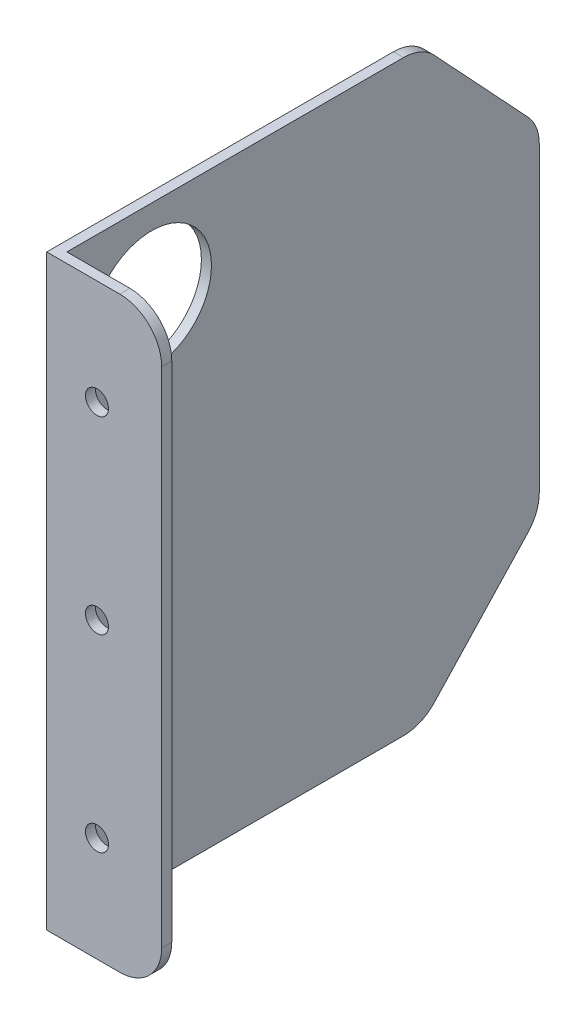
ISO-10303-21;
HEADER;
FILE_DESCRIPTION(('STEP AP214'),'2;1');
FILE_NAME('part.step','',(''),(''),'','','');
FILE_SCHEMA(('AUTOMOTIVE_DESIGN { 1 0 10303 214 1 1 1 1 }'));
ENDSEC;
DATA;
#1=APPLICATION_CONTEXT('core data for automotive mechanical design processes');
#2=APPLICATION_PROTOCOL_DEFINITION('international standard','automotive_design',2000,#1);
#3=PRODUCT_CONTEXT('',#1,'mechanical');
#4=PRODUCT('Part','Part','',(#3));
#5=PRODUCT_RELATED_PRODUCT_CATEGORY('part','',(#4));
#6=PRODUCT_DEFINITION_FORMATION('','',#4);
#7=PRODUCT_DEFINITION_CONTEXT('part definition',#1,'design');
#8=PRODUCT_DEFINITION('design','',#6,#7);
#9=PRODUCT_DEFINITION_SHAPE('','',#8);
#10=(LENGTH_UNIT() NAMED_UNIT(*) SI_UNIT(.MILLI.,.METRE.));
#11=(NAMED_UNIT(*) PLANE_ANGLE_UNIT() SI_UNIT($,.RADIAN.));
#12=(NAMED_UNIT(*) SI_UNIT($,.STERADIAN.) SOLID_ANGLE_UNIT());
#13=UNCERTAINTY_MEASURE_WITH_UNIT(LENGTH_MEASURE(1.E-05),#10,'distance_accuracy_value','');
#14=(GEOMETRIC_REPRESENTATION_CONTEXT(3) GLOBAL_UNCERTAINTY_ASSIGNED_CONTEXT((#13)) GLOBAL_UNIT_ASSIGNED_CONTEXT((#10,
#11,#12)) REPRESENTATION_CONTEXT('',''));
#15=CARTESIAN_POINT('',(0.,0.,0.));
#16=DIRECTION('',(0.,0.,1.));
#17=DIRECTION('',(1.,0.,0.));
#18=AXIS2_PLACEMENT_3D('',#15,#16,#17);
#19=CARTESIAN_POINT('',(2.4,0.,0.));
#20=DIRECTION('',(0.,0.,-1.));
#21=DIRECTION('',(0.,1.,0.));
#22=AXIS2_PLACEMENT_3D('',#19,#20,#21);
#23=PLANE('',#22);
#24=CARTESIAN_POINT('',(11.9749835807568,-115.,0.));
#25=DIRECTION('',(0.,0.,1.));
#26=DIRECTION('',(1.,0.,0.));
#27=AXIS2_PLACEMENT_3D('',#24,#25,#26);
#28=CIRCLE('',#27,2.75);
#29=CARTESIAN_POINT('',(14.7249835807568,-115.,0.));
#30=VERTEX_POINT('',#29);
#31=EDGE_CURVE('E492',#30,#30,#28,.T.);
#32=ORIENTED_EDGE('',*,*,#31,.F.);
#33=EDGE_LOOP('',(#32));
#34=FACE_BOUND('',#33,.T.);
#35=CARTESIAN_POINT('',(11.9749835807568,-25.,0.));
#36=DIRECTION('',(0.,0.,1.));
#37=DIRECTION('',(1.,0.,0.));
#38=AXIS2_PLACEMENT_3D('',#35,#36,#37);
#39=CIRCLE('',#38,2.75);
#40=CARTESIAN_POINT('',(14.7249835807568,-25.,0.));
#41=VERTEX_POINT('',#40);
#42=EDGE_CURVE('E497',#41,#41,#39,.T.);
#43=ORIENTED_EDGE('',*,*,#42,.F.);
#44=EDGE_LOOP('',(#43));
#45=FACE_BOUND('',#44,.T.);
#46=CARTESIAN_POINT('',(11.9749835807568,-70.,0.));
#47=DIRECTION('',(0.,0.,1.));
#48=DIRECTION('',(1.,0.,0.));
#49=AXIS2_PLACEMENT_3D('',#46,#47,#48);
#50=CIRCLE('',#49,2.75);
#51=CARTESIAN_POINT('',(14.7249835807568,-70.,0.));
#52=VERTEX_POINT('',#51);
#53=EDGE_CURVE('E258',#52,#52,#50,.T.);
#54=ORIENTED_EDGE('',*,*,#53,.F.);
#55=EDGE_LOOP('',(#54));
#56=FACE_BOUND('',#55,.T.);
#57=DIRECTION('',(-1.,0.,0.));
#58=VECTOR('',#57,1.);
#59=CARTESIAN_POINT('',(2.4,-140.,0.));
#60=LINE('',#59,#58);
#61=CARTESIAN_POINT('',(17.4,-140.,0.));
#62=VERTEX_POINT('',#61);
#63=CARTESIAN_POINT('',(0.,-140.,0.));
#64=VERTEX_POINT('',#63);
#65=EDGE_CURVE('E204',#62,#64,#60,.T.);
#66=ORIENTED_EDGE('',*,*,#65,.F.);
#67=CARTESIAN_POINT('',(17.4,-130.,0.));
#68=DIRECTION('',(0.,0.,-1.));
#69=DIRECTION('',(0.,1.,0.));
#70=AXIS2_PLACEMENT_3D('',#67,#68,#69);
#71=CIRCLE('',#70,10.);
#72=CARTESIAN_POINT('',(27.4,-130.,0.));
#73=VERTEX_POINT('',#72);
#74=EDGE_CURVE('E48',#62,#73,#71,.F.);
#75=ORIENTED_EDGE('',*,*,#74,.T.);
#76=DIRECTION('',(0.,-1.,0.));
#77=VECTOR('',#76,1.);
#78=CARTESIAN_POINT('',(27.4,-140.,0.));
#79=LINE('',#78,#77);
#80=CARTESIAN_POINT('',(27.4,-10.,0.));
#81=VERTEX_POINT('',#80);
#82=EDGE_CURVE('E167',#81,#73,#79,.T.);
#83=ORIENTED_EDGE('',*,*,#82,.F.);
#84=CARTESIAN_POINT('',(17.4,-10.,0.));
#85=DIRECTION('',(0.,0.,-1.));
#86=DIRECTION('',(0.,1.,0.));
#87=AXIS2_PLACEMENT_3D('',#84,#85,#86);
#88=CIRCLE('',#87,10.);
#89=CARTESIAN_POINT('',(17.4,0.,0.));
#90=VERTEX_POINT('',#89);
#91=EDGE_CURVE('E57',#81,#90,#88,.F.);
#92=ORIENTED_EDGE('',*,*,#91,.T.);
#93=DIRECTION('',(-1.,0.,0.));
#94=VECTOR('',#93,1.);
#95=CARTESIAN_POINT('',(2.4,0.,0.));
#96=LINE('',#95,#94);
#97=CARTESIAN_POINT('',(0.,0.,0.));
#98=VERTEX_POINT('',#97);
#99=EDGE_CURVE('E161',#90,#98,#96,.T.);
#100=ORIENTED_EDGE('',*,*,#99,.T.);
#101=DIRECTION('',(0.,-1.,0.));
#102=VECTOR('',#101,1.);
#103=CARTESIAN_POINT('',(0.,0.,0.));
#104=LINE('',#103,#102);
#105=EDGE_CURVE('E176',#98,#64,#104,.T.);
#106=ORIENTED_EDGE('',*,*,#105,.T.);
#107=EDGE_LOOP('',(#66,#75,#83,#92,#100,#106));
#108=FACE_BOUND('',#107,.T.);
#109=ADVANCED_FACE('F39',(#34,#45,#56,#108),#23,.F.);
#110=CARTESIAN_POINT('',(2.4,-140.,0.));
#111=DIRECTION('',(0.,1.,0.));
#112=DIRECTION('',(0.,0.,1.));
#113=AXIS2_PLACEMENT_3D('',#110,#111,#112);
#114=PLANE('',#113);
#115=DIRECTION('',(-1.,0.,0.));
#116=VECTOR('',#115,1.);
#117=CARTESIAN_POINT('',(27.4,-140.,-2.4));
#118=LINE('',#117,#116);
#119=CARTESIAN_POINT('',(17.4,-140.,-2.4));
#120=VERTEX_POINT('',#119);
#121=CARTESIAN_POINT('',(2.4,-140.,-2.4));
#122=VERTEX_POINT('',#121);
#123=EDGE_CURVE('E151',#120,#122,#118,.T.);
#124=ORIENTED_EDGE('',*,*,#123,.F.);
#125=DIRECTION('',(0.,0.,-1.));
#126=VECTOR('',#125,1.);
#127=CARTESIAN_POINT('',(17.4,-140.,0.));
#128=LINE('',#127,#126);
#129=EDGE_CURVE('E61',#120,#62,#128,.F.);
#130=ORIENTED_EDGE('',*,*,#129,.T.);
#131=ORIENTED_EDGE('',*,*,#65,.T.);
#132=DIRECTION('',(0.,0.,-1.));
#133=VECTOR('',#132,1.);
#134=CARTESIAN_POINT('',(0.,-140.,0.));
#135=LINE('',#134,#133);
#136=CARTESIAN_POINT('',(0.,-140.,-82.6544769808779));
#137=VERTEX_POINT('',#136);
#138=EDGE_CURVE('E193',#64,#137,#135,.T.);
#139=ORIENTED_EDGE('',*,*,#138,.T.);
#140=DIRECTION('',(1.,0.,0.));
#141=VECTOR('',#140,1.);
#142=CARTESIAN_POINT('',(2.4,-140.,-82.6544769808779));
#143=LINE('',#142,#141);
#144=CARTESIAN_POINT('',(2.4,-140.,-82.6544769808779));
#145=VERTEX_POINT('',#144);
#146=EDGE_CURVE('E206',#137,#145,#143,.T.);
#147=ORIENTED_EDGE('',*,*,#146,.T.);
#148=DIRECTION('',(0.,0.,-1.));
#149=VECTOR('',#148,1.);
#150=CARTESIAN_POINT('',(2.4,-140.,0.));
#151=LINE('',#150,#149);
#152=EDGE_CURVE('E190',#122,#145,#151,.T.);
#153=ORIENTED_EDGE('',*,*,#152,.F.);
#154=EDGE_LOOP('',(#124,#130,#131,#139,#147,#153));
#155=FACE_BOUND('',#154,.T.);
#156=ADVANCED_FACE('F278',(#155),#114,.F.);
#157=CARTESIAN_POINT('',(2.4,0.,-115.));
#158=DIRECTION('',(0.,0.,1.));
#159=DIRECTION('',(0.,-1.,0.));
#160=AXIS2_PLACEMENT_3D('',#157,#158,#159);
#161=PLANE('',#160);
#162=DIRECTION('',(0.,1.,0.));
#163=VECTOR('',#162,1.);
#164=CARTESIAN_POINT('',(2.4,0.,-115.));
#165=LINE('',#164,#163);
#166=CARTESIAN_POINT('',(2.4,-106.058368193798,-115.));
#167=VERTEX_POINT('',#166);
#168=CARTESIAN_POINT('',(2.4,-33.9416318062023,-115.));
#169=VERTEX_POINT('',#168);
#170=EDGE_CURVE('E165',#167,#169,#165,.T.);
#171=ORIENTED_EDGE('',*,*,#170,.F.);
#172=DIRECTION('',(1.,0.,0.));
#173=VECTOR('',#172,1.);
#174=CARTESIAN_POINT('',(2.4,-106.058368193798,-115.));
#175=LINE('',#174,#173);
#176=CARTESIAN_POINT('',(0.,-106.058368193798,-115.));
#177=VERTEX_POINT('',#176);
#178=EDGE_CURVE('E234',#167,#177,#175,.F.);
#179=ORIENTED_EDGE('',*,*,#178,.T.);
#180=DIRECTION('',(0.,1.,0.));
#181=VECTOR('',#180,1.);
#182=CARTESIAN_POINT('',(0.,0.,-115.));
#183=LINE('',#182,#181);
#184=CARTESIAN_POINT('',(0.,-33.9416318062023,-115.));
#185=VERTEX_POINT('',#184);
#186=EDGE_CURVE('E196',#177,#185,#183,.T.);
#187=ORIENTED_EDGE('',*,*,#186,.T.);
#188=DIRECTION('',(1.,0.,0.));
#189=VECTOR('',#188,1.);
#190=CARTESIAN_POINT('',(2.4,-33.9416318062023,-115.));
#191=LINE('',#190,#189);
#192=EDGE_CURVE('E226',#185,#169,#191,.T.);
#193=ORIENTED_EDGE('',*,*,#192,.T.);
#194=EDGE_LOOP('',(#171,#179,#187,#193));
#195=FACE_BOUND('',#194,.T.);
#196=ADVANCED_FACE('F290',(#195),#161,.F.);
#197=CARTESIAN_POINT('',(2.4,0.,0.));
#198=DIRECTION('',(0.,-1.,0.));
#199=DIRECTION('',(0.,0.,-1.));
#200=AXIS2_PLACEMENT_3D('',#197,#198,#199);
#201=PLANE('',#200);
#202=ORIENTED_EDGE('',*,*,#99,.F.);
#203=DIRECTION('',(0.,0.,1.));
#204=VECTOR('',#203,1.);
#205=CARTESIAN_POINT('',(17.4,0.,0.));
#206=LINE('',#205,#204);
#207=CARTESIAN_POINT('',(17.4,0.,-2.4));
#208=VERTEX_POINT('',#207);
#209=EDGE_CURVE('E11',#90,#208,#206,.F.);
#210=ORIENTED_EDGE('',*,*,#209,.T.);
#211=DIRECTION('',(-1.,0.,0.));
#212=VECTOR('',#211,1.);
#213=CARTESIAN_POINT('',(27.4,0.,-2.4));
#214=LINE('',#213,#212);
#215=CARTESIAN_POINT('',(2.4,0.,-2.4));
#216=VERTEX_POINT('',#215);
#217=EDGE_CURVE('E142',#208,#216,#214,.T.);
#218=ORIENTED_EDGE('',*,*,#217,.T.);
#219=DIRECTION('',(0.,0.,1.));
#220=VECTOR('',#219,1.);
#221=CARTESIAN_POINT('',(2.4,0.,0.));
#222=LINE('',#221,#220);
#223=CARTESIAN_POINT('',(2.4,0.,-82.6544769808779));
#224=VERTEX_POINT('',#223);
#225=EDGE_CURVE('E144',#224,#216,#222,.T.);
#226=ORIENTED_EDGE('',*,*,#225,.F.);
#227=DIRECTION('',(1.,0.,0.));
#228=VECTOR('',#227,1.);
#229=CARTESIAN_POINT('',(2.4,0.,-82.6544769808779));
#230=LINE('',#229,#228);
#231=CARTESIAN_POINT('',(0.,0.,-82.6544769808779));
#232=VERTEX_POINT('',#231);
#233=EDGE_CURVE('E239',#224,#232,#230,.F.);
#234=ORIENTED_EDGE('',*,*,#233,.T.);
#235=DIRECTION('',(0.,0.,1.));
#236=VECTOR('',#235,1.);
#237=CARTESIAN_POINT('',(0.,0.,0.));
#238=LINE('',#237,#236);
#239=EDGE_CURVE('E188',#232,#98,#238,.T.);
#240=ORIENTED_EDGE('',*,*,#239,.T.);
#241=EDGE_LOOP('',(#202,#210,#218,#226,#234,#240));
#242=FACE_BOUND('',#241,.T.);
#243=ADVANCED_FACE('F145',(#242),#201,.F.);
#244=CARTESIAN_POINT('',(2.4,0.,0.));
#245=DIRECTION('',(1.,0.,0.));
#246=DIRECTION('',(0.,0.,-1.));
#247=AXIS2_PLACEMENT_3D('',#244,#245,#246);
#248=PLANE('',#247);
#249=CARTESIAN_POINT('',(2.4,-20.,-22.5916993338302));
#250=DIRECTION('',(1.,0.,0.));
#251=DIRECTION('',(0.,0.,-1.));
#252=AXIS2_PLACEMENT_3D('',#249,#250,#251);
#253=CIRCLE('',#252,14.275);
#254=CARTESIAN_POINT('',(2.4,-20.,-36.8666993338302));
#255=VERTEX_POINT('',#254);
#256=EDGE_CURVE('E491',#255,#255,#253,.T.);
#257=ORIENTED_EDGE('',*,*,#256,.F.);
#258=EDGE_LOOP('',(#257));
#259=FACE_BOUND('',#258,.T.);
#260=DIRECTION('',(0.,1.,0.));
#261=VECTOR('',#260,1.);
#262=CARTESIAN_POINT('',(2.4,-140.,-2.4));
#263=LINE('',#262,#261);
#264=EDGE_CURVE('E160',#122,#216,#263,.T.);
#265=ORIENTED_EDGE('',*,*,#264,.F.);
#266=ORIENTED_EDGE('',*,*,#152,.T.);
#267=CARTESIAN_POINT('',(2.4,-130.,-82.6544769808779));
#268=DIRECTION('',(1.,0.,0.));
#269=DIRECTION('',(0.,0.,-1.));
#270=AXIS2_PLACEMENT_3D('',#267,#268,#269);
#271=CIRCLE('',#270,10.);
#272=CARTESIAN_POINT('',(2.4,-136.8231825036,-89.9650296633066));
#273=VERTEX_POINT('',#272);
#274=EDGE_CURVE('E212',#145,#273,#271,.T.);
#275=ORIENTED_EDGE('',*,*,#274,.T.);
#276=DIRECTION('',(0.,-0.731055268242869,0.682318250360011));
#277=VECTOR('',#276,1.);
#278=CARTESIAN_POINT('',(2.4,-110.,-115.));
#279=LINE('',#278,#277);
#280=CARTESIAN_POINT('',(2.4,-112.881550697398,-112.310552682429));
#281=VERTEX_POINT('',#280);
#282=EDGE_CURVE('E181',#281,#273,#279,.T.);
#283=ORIENTED_EDGE('',*,*,#282,.F.);
#284=CARTESIAN_POINT('',(2.4,-106.058368193798,-105.));
#285=DIRECTION('',(1.,0.,0.));
#286=DIRECTION('',(0.,0.,-1.));
#287=AXIS2_PLACEMENT_3D('',#284,#285,#286);
#288=CIRCLE('',#287,10.);
#289=EDGE_CURVE('E215',#281,#167,#288,.T.);
#290=ORIENTED_EDGE('',*,*,#289,.T.);
#291=ORIENTED_EDGE('',*,*,#170,.T.);
#292=CARTESIAN_POINT('',(2.4,-33.9416318062023,-105.));
#293=DIRECTION('',(1.,0.,0.));
#294=DIRECTION('',(0.,0.,-1.));
#295=AXIS2_PLACEMENT_3D('',#292,#293,#294);
#296=CIRCLE('',#295,10.);
#297=CARTESIAN_POINT('',(2.4,-27.1184493026022,-112.310552682429));
#298=VERTEX_POINT('',#297);
#299=EDGE_CURVE('E209',#169,#298,#296,.T.);
#300=ORIENTED_EDGE('',*,*,#299,.T.);
#301=DIRECTION('',(0.,-0.731055268242869,-0.682318250360012));
#302=VECTOR('',#301,1.);
#303=CARTESIAN_POINT('',(2.4,0.,-87.));
#304=LINE('',#303,#302);
#305=CARTESIAN_POINT('',(2.4,-3.17681749639988,-89.9650296633066));
#306=VERTEX_POINT('',#305);
#307=EDGE_CURVE('E178',#306,#298,#304,.T.);
#308=ORIENTED_EDGE('',*,*,#307,.F.);
#309=CARTESIAN_POINT('',(2.4,-10.,-82.6544769808779));
#310=DIRECTION('',(1.,0.,0.));
#311=DIRECTION('',(0.,0.,-1.));
#312=AXIS2_PLACEMENT_3D('',#309,#310,#311);
#313=CIRCLE('',#312,10.);
#314=EDGE_CURVE('E159',#306,#224,#313,.T.);
#315=ORIENTED_EDGE('',*,*,#314,.T.);
#316=ORIENTED_EDGE('',*,*,#225,.T.);
#317=EDGE_LOOP('',(#265,#266,#275,#283,#290,#291,#300,#308,#315,#316));
#318=FACE_BOUND('',#317,.T.);
#319=ADVANCED_FACE('F156',(#259,#318),#248,.T.);
#320=CARTESIAN_POINT('',(0.,0.,0.));
#321=DIRECTION('',(1.,0.,0.));
#322=DIRECTION('',(0.,0.,-1.));
#323=AXIS2_PLACEMENT_3D('',#320,#321,#322);
#324=PLANE('',#323);
#325=CARTESIAN_POINT('',(0.,-20.,-22.5916993338302));
#326=DIRECTION('',(1.,0.,0.));
#327=DIRECTION('',(0.,0.,-1.));
#328=AXIS2_PLACEMENT_3D('',#325,#326,#327);
#329=CIRCLE('',#328,14.275);
#330=CARTESIAN_POINT('',(0.,-20.,-36.8666993338302));
#331=VERTEX_POINT('',#330);
#332=EDGE_CURVE('E488',#331,#331,#329,.T.);
#333=ORIENTED_EDGE('',*,*,#332,.T.);
#334=EDGE_LOOP('',(#333));
#335=FACE_BOUND('',#334,.T.);
#336=DIRECTION('',(0.,-0.731055268242869,0.682318250360011));
#337=VECTOR('',#336,1.);
#338=CARTESIAN_POINT('',(0.,-110.,-115.));
#339=LINE('',#338,#337);
#340=CARTESIAN_POINT('',(0.,-112.881550697398,-112.310552682429));
#341=VERTEX_POINT('',#340);
#342=CARTESIAN_POINT('',(0.,-136.8231825036,-89.9650296633066));
#343=VERTEX_POINT('',#342);
#344=EDGE_CURVE('E173',#341,#343,#339,.T.);
#345=ORIENTED_EDGE('',*,*,#344,.T.);
#346=CARTESIAN_POINT('',(0.,-130.,-82.6544769808779));
#347=DIRECTION('',(1.,0.,0.));
#348=DIRECTION('',(0.,0.,-1.));
#349=AXIS2_PLACEMENT_3D('',#346,#347,#348);
#350=CIRCLE('',#349,10.);
#351=EDGE_CURVE('E229',#343,#137,#350,.F.);
#352=ORIENTED_EDGE('',*,*,#351,.T.);
#353=ORIENTED_EDGE('',*,*,#138,.F.);
#354=ORIENTED_EDGE('',*,*,#105,.F.);
#355=ORIENTED_EDGE('',*,*,#239,.F.);
#356=CARTESIAN_POINT('',(0.,-10.,-82.6544769808779));
#357=DIRECTION('',(1.,0.,0.));
#358=DIRECTION('',(0.,0.,-1.));
#359=AXIS2_PLACEMENT_3D('',#356,#357,#358);
#360=CIRCLE('',#359,10.);
#361=CARTESIAN_POINT('',(0.,-3.17681749639988,-89.9650296633066));
#362=VERTEX_POINT('',#361);
#363=EDGE_CURVE('E222',#232,#362,#360,.F.);
#364=ORIENTED_EDGE('',*,*,#363,.T.);
#365=DIRECTION('',(0.,-0.731055268242869,-0.682318250360012));
#366=VECTOR('',#365,1.);
#367=CARTESIAN_POINT('',(0.,0.,-87.));
#368=LINE('',#367,#366);
#369=CARTESIAN_POINT('',(0.,-27.1184493026022,-112.310552682429));
#370=VERTEX_POINT('',#369);
#371=EDGE_CURVE('E177',#362,#370,#368,.T.);
#372=ORIENTED_EDGE('',*,*,#371,.T.);
#373=CARTESIAN_POINT('',(0.,-33.9416318062023,-105.));
#374=DIRECTION('',(1.,0.,0.));
#375=DIRECTION('',(0.,0.,-1.));
#376=AXIS2_PLACEMENT_3D('',#373,#374,#375);
#377=CIRCLE('',#376,10.);
#378=EDGE_CURVE('E224',#370,#185,#377,.F.);
#379=ORIENTED_EDGE('',*,*,#378,.T.);
#380=ORIENTED_EDGE('',*,*,#186,.F.);
#381=CARTESIAN_POINT('',(0.,-106.058368193798,-105.));
#382=DIRECTION('',(1.,0.,0.));
#383=DIRECTION('',(0.,0.,-1.));
#384=AXIS2_PLACEMENT_3D('',#381,#382,#383);
#385=CIRCLE('',#384,10.);
#386=EDGE_CURVE('E223',#177,#341,#385,.F.);
#387=ORIENTED_EDGE('',*,*,#386,.T.);
#388=EDGE_LOOP('',(#345,#352,#353,#354,#355,#364,#372,#379,#380,#387));
#389=FACE_BOUND('',#388,.T.);
#390=ADVANCED_FACE('F334',(#335,#389),#324,.F.);
#391=CARTESIAN_POINT('',(0.,0.,-87.));
#392=DIRECTION('',(0.,-0.682318250360011,0.731055268242869));
#393=DIRECTION('',(0.,-0.731055268242869,-0.682318250360012));
#394=AXIS2_PLACEMENT_3D('',#391,#392,#393);
#395=PLANE('',#394);
#396=ORIENTED_EDGE('',*,*,#307,.T.);
#397=DIRECTION('',(1.,0.,0.));
#398=VECTOR('',#397,1.);
#399=CARTESIAN_POINT('',(0.,-27.1184493026021,-112.310552682429));
#400=LINE('',#399,#398);
#401=EDGE_CURVE('E240',#298,#370,#400,.F.);
#402=ORIENTED_EDGE('',*,*,#401,.T.);
#403=ORIENTED_EDGE('',*,*,#371,.F.);
#404=DIRECTION('',(1.,0.,0.));
#405=VECTOR('',#404,1.);
#406=CARTESIAN_POINT('',(0.,-3.17681749639988,-89.9650296633066));
#407=LINE('',#406,#405);
#408=EDGE_CURVE('E231',#362,#306,#407,.T.);
#409=ORIENTED_EDGE('',*,*,#408,.T.);
#410=EDGE_LOOP('',(#396,#402,#403,#409));
#411=FACE_BOUND('',#410,.T.);
#412=ADVANCED_FACE('F341',(#411),#395,.F.);
#413=CARTESIAN_POINT('',(0.,-110.,-115.));
#414=DIRECTION('',(0.,0.682318250360011,0.731055268242869));
#415=DIRECTION('',(0.,-0.731055268242869,0.682318250360011));
#416=AXIS2_PLACEMENT_3D('',#413,#414,#415);
#417=PLANE('',#416);
#418=ORIENTED_EDGE('',*,*,#282,.T.);
#419=DIRECTION('',(1.,0.,0.));
#420=VECTOR('',#419,1.);
#421=CARTESIAN_POINT('',(0.,-136.8231825036,-89.9650296633066));
#422=LINE('',#421,#420);
#423=EDGE_CURVE('E218',#273,#343,#422,.F.);
#424=ORIENTED_EDGE('',*,*,#423,.T.);
#425=ORIENTED_EDGE('',*,*,#344,.F.);
#426=DIRECTION('',(1.,0.,0.));
#427=VECTOR('',#426,1.);
#428=CARTESIAN_POINT('',(0.,-112.881550697398,-112.310552682429));
#429=LINE('',#428,#427);
#430=EDGE_CURVE('E216',#341,#281,#429,.T.);
#431=ORIENTED_EDGE('',*,*,#430,.T.);
#432=EDGE_LOOP('',(#418,#424,#425,#431));
#433=FACE_BOUND('',#432,.T.);
#434=ADVANCED_FACE('F300',(#433),#417,.F.);
#435=CARTESIAN_POINT('',(2.4,-130.,-82.6544769808779));
#436=DIRECTION('',(1.,0.,0.));
#437=DIRECTION('',(0.,0.,-1.));
#438=AXIS2_PLACEMENT_3D('',#435,#436,#437);
#439=CYLINDRICAL_SURFACE('',#438,10.);
#440=ORIENTED_EDGE('',*,*,#351,.F.);
#441=ORIENTED_EDGE('',*,*,#423,.F.);
#442=ORIENTED_EDGE('',*,*,#274,.F.);
#443=ORIENTED_EDGE('',*,*,#146,.F.);
#444=EDGE_LOOP('',(#440,#441,#442,#443));
#445=FACE_BOUND('',#444,.T.);
#446=ADVANCED_FACE('F294',(#445),#439,.T.);
#447=CARTESIAN_POINT('',(0.,-106.058368193798,-105.));
#448=DIRECTION('',(1.,0.,0.));
#449=DIRECTION('',(0.,0.,-1.));
#450=AXIS2_PLACEMENT_3D('',#447,#448,#449);
#451=CYLINDRICAL_SURFACE('',#450,10.);
#452=ORIENTED_EDGE('',*,*,#386,.F.);
#453=ORIENTED_EDGE('',*,*,#178,.F.);
#454=ORIENTED_EDGE('',*,*,#289,.F.);
#455=ORIENTED_EDGE('',*,*,#430,.F.);
#456=EDGE_LOOP('',(#452,#453,#454,#455));
#457=FACE_BOUND('',#456,.T.);
#458=ADVANCED_FACE('F299',(#457),#451,.T.);
#459=CARTESIAN_POINT('',(2.4,-33.9416318062023,-105.));
#460=DIRECTION('',(1.,0.,0.));
#461=DIRECTION('',(0.,0.,-1.));
#462=AXIS2_PLACEMENT_3D('',#459,#460,#461);
#463=CYLINDRICAL_SURFACE('',#462,10.);
#464=ORIENTED_EDGE('',*,*,#378,.F.);
#465=ORIENTED_EDGE('',*,*,#401,.F.);
#466=ORIENTED_EDGE('',*,*,#299,.F.);
#467=ORIENTED_EDGE('',*,*,#192,.F.);
#468=EDGE_LOOP('',(#464,#465,#466,#467));
#469=FACE_BOUND('',#468,.T.);
#470=ADVANCED_FACE('F304',(#469),#463,.T.);
#471=CARTESIAN_POINT('',(0.,-10.,-82.6544769808779));
#472=DIRECTION('',(1.,0.,0.));
#473=DIRECTION('',(0.,0.,-1.));
#474=AXIS2_PLACEMENT_3D('',#471,#472,#473);
#475=CYLINDRICAL_SURFACE('',#474,10.);
#476=ORIENTED_EDGE('',*,*,#363,.F.);
#477=ORIENTED_EDGE('',*,*,#233,.F.);
#478=ORIENTED_EDGE('',*,*,#314,.F.);
#479=ORIENTED_EDGE('',*,*,#408,.F.);
#480=EDGE_LOOP('',(#476,#477,#478,#479));
#481=FACE_BOUND('',#480,.T.);
#482=ADVANCED_FACE('F308',(#481),#475,.T.);
#483=CARTESIAN_POINT('',(27.4,-140.,-2.4));
#484=DIRECTION('',(0.,0.,1.));
#485=DIRECTION('',(1.,0.,0.));
#486=AXIS2_PLACEMENT_3D('',#483,#484,#485);
#487=PLANE('',#486);
#488=CARTESIAN_POINT('',(11.9749835807568,-115.,-2.4));
#489=DIRECTION('',(0.,0.,1.));
#490=DIRECTION('',(1.,0.,0.));
#491=AXIS2_PLACEMENT_3D('',#488,#489,#490);
#492=CIRCLE('',#491,2.75);
#493=CARTESIAN_POINT('',(14.7249835807568,-115.,-2.4));
#494=VERTEX_POINT('',#493);
#495=EDGE_CURVE('E43',#494,#494,#492,.T.);
#496=ORIENTED_EDGE('',*,*,#495,.T.);
#497=EDGE_LOOP('',(#496));
#498=FACE_BOUND('',#497,.T.);
#499=CARTESIAN_POINT('',(11.9749835807568,-25.,-2.4));
#500=DIRECTION('',(0.,0.,1.));
#501=DIRECTION('',(1.,0.,0.));
#502=AXIS2_PLACEMENT_3D('',#499,#500,#501);
#503=CIRCLE('',#502,2.75);
#504=CARTESIAN_POINT('',(14.7249835807568,-25.,-2.4));
#505=VERTEX_POINT('',#504);
#506=EDGE_CURVE('E172',#505,#505,#503,.T.);
#507=ORIENTED_EDGE('',*,*,#506,.T.);
#508=EDGE_LOOP('',(#507));
#509=FACE_BOUND('',#508,.T.);
#510=CARTESIAN_POINT('',(11.9749835807568,-70.,-2.4));
#511=DIRECTION('',(0.,0.,1.));
#512=DIRECTION('',(1.,0.,0.));
#513=AXIS2_PLACEMENT_3D('',#510,#511,#512);
#514=CIRCLE('',#513,2.75);
#515=CARTESIAN_POINT('',(14.7249835807568,-70.,-2.4));
#516=VERTEX_POINT('',#515);
#517=EDGE_CURVE('E255',#516,#516,#514,.T.);
#518=ORIENTED_EDGE('',*,*,#517,.T.);
#519=EDGE_LOOP('',(#518));
#520=FACE_BOUND('',#519,.T.);
#521=DIRECTION('',(0.,1.,0.));
#522=VECTOR('',#521,1.);
#523=CARTESIAN_POINT('',(27.4,-140.,-2.4));
#524=LINE('',#523,#522);
#525=CARTESIAN_POINT('',(27.4,-130.,-2.4));
#526=VERTEX_POINT('',#525);
#527=CARTESIAN_POINT('',(27.4,-10.,-2.4));
#528=VERTEX_POINT('',#527);
#529=EDGE_CURVE('E155',#526,#528,#524,.T.);
#530=ORIENTED_EDGE('',*,*,#529,.F.);
#531=CARTESIAN_POINT('',(17.4,-130.,-2.4));
#532=DIRECTION('',(0.,0.,1.));
#533=DIRECTION('',(1.,0.,0.));
#534=AXIS2_PLACEMENT_3D('',#531,#532,#533);
#535=CIRCLE('',#534,10.);
#536=EDGE_CURVE('E246',#526,#120,#535,.F.);
#537=ORIENTED_EDGE('',*,*,#536,.T.);
#538=ORIENTED_EDGE('',*,*,#123,.T.);
#539=ORIENTED_EDGE('',*,*,#264,.T.);
#540=ORIENTED_EDGE('',*,*,#217,.F.);
#541=CARTESIAN_POINT('',(17.4,-10.,-2.4));
#542=DIRECTION('',(0.,0.,1.));
#543=DIRECTION('',(1.,0.,0.));
#544=AXIS2_PLACEMENT_3D('',#541,#542,#543);
#545=CIRCLE('',#544,10.);
#546=EDGE_CURVE('E249',#208,#528,#545,.F.);
#547=ORIENTED_EDGE('',*,*,#546,.T.);
#548=EDGE_LOOP('',(#530,#537,#538,#539,#540,#547));
#549=FACE_BOUND('',#548,.T.);
#550=ADVANCED_FACE('F164',(#498,#509,#520,#549),#487,.F.);
#551=CARTESIAN_POINT('',(27.4,0.,0.));
#552=DIRECTION('',(-1.,0.,0.));
#553=DIRECTION('',(0.,0.,1.));
#554=AXIS2_PLACEMENT_3D('',#551,#552,#553);
#555=PLANE('',#554);
#556=ORIENTED_EDGE('',*,*,#82,.T.);
#557=DIRECTION('',(0.,0.,-1.));
#558=VECTOR('',#557,1.);
#559=CARTESIAN_POINT('',(27.4,-130.,0.));
#560=LINE('',#559,#558);
#561=EDGE_CURVE('E241',#73,#526,#560,.T.);
#562=ORIENTED_EDGE('',*,*,#561,.T.);
#563=ORIENTED_EDGE('',*,*,#529,.T.);
#564=DIRECTION('',(0.,0.,1.));
#565=VECTOR('',#564,1.);
#566=CARTESIAN_POINT('',(27.4,-10.,0.));
#567=LINE('',#566,#565);
#568=EDGE_CURVE('E242',#528,#81,#567,.T.);
#569=ORIENTED_EDGE('',*,*,#568,.T.);
#570=EDGE_LOOP('',(#556,#562,#563,#569));
#571=FACE_BOUND('',#570,.T.);
#572=ADVANCED_FACE('F315',(#571),#555,.F.);
#573=CARTESIAN_POINT('',(17.4,-130.,0.));
#574=DIRECTION('',(0.,0.,-1.));
#575=DIRECTION('',(-1.,0.,0.));
#576=AXIS2_PLACEMENT_3D('',#573,#574,#575);
#577=CYLINDRICAL_SURFACE('',#576,10.);
#578=ORIENTED_EDGE('',*,*,#74,.F.);
#579=ORIENTED_EDGE('',*,*,#129,.F.);
#580=ORIENTED_EDGE('',*,*,#536,.F.);
#581=ORIENTED_EDGE('',*,*,#561,.F.);
#582=EDGE_LOOP('',(#578,#579,#580,#581));
#583=FACE_BOUND('',#582,.T.);
#584=ADVANCED_FACE('F309',(#583),#577,.T.);
#585=CARTESIAN_POINT('',(17.4,-10.,0.));
#586=DIRECTION('',(0.,0.,1.));
#587=DIRECTION('',(1.,0.,0.));
#588=AXIS2_PLACEMENT_3D('',#585,#586,#587);
#589=CYLINDRICAL_SURFACE('',#588,10.);
#590=ORIENTED_EDGE('',*,*,#546,.F.);
#591=ORIENTED_EDGE('',*,*,#209,.F.);
#592=ORIENTED_EDGE('',*,*,#91,.F.);
#593=ORIENTED_EDGE('',*,*,#568,.F.);
#594=EDGE_LOOP('',(#590,#591,#592,#593));
#595=FACE_BOUND('',#594,.T.);
#596=ADVANCED_FACE('F41',(#595),#589,.T.);
#597=CARTESIAN_POINT('',(11.9749835807568,-70.,-115.));
#598=DIRECTION('',(0.,0.,1.));
#599=DIRECTION('',(1.,0.,0.));
#600=AXIS2_PLACEMENT_3D('',#597,#598,#599);
#601=CYLINDRICAL_SURFACE('',#600,2.75);
#602=ORIENTED_EDGE('',*,*,#53,.T.);
#603=EDGE_LOOP('',(#602));
#604=FACE_BOUND('',#603,.T.);
#605=ORIENTED_EDGE('',*,*,#517,.F.);
#606=EDGE_LOOP('',(#605));
#607=FACE_BOUND('',#606,.T.);
#608=ADVANCED_FACE('F264',(#604,#607),#601,.F.);
#609=CARTESIAN_POINT('',(11.9749835807568,-25.,-115.));
#610=DIRECTION('',(0.,0.,1.));
#611=DIRECTION('',(1.,0.,0.));
#612=AXIS2_PLACEMENT_3D('',#609,#610,#611);
#613=CYLINDRICAL_SURFACE('',#612,2.75);
#614=ORIENTED_EDGE('',*,*,#42,.T.);
#615=EDGE_LOOP('',(#614));
#616=FACE_BOUND('',#615,.T.);
#617=ORIENTED_EDGE('',*,*,#506,.F.);
#618=EDGE_LOOP('',(#617));
#619=FACE_BOUND('',#618,.T.);
#620=ADVANCED_FACE('F265',(#616,#619),#613,.F.);
#621=CARTESIAN_POINT('',(11.9749835807568,-115.,-115.));
#622=DIRECTION('',(0.,0.,1.));
#623=DIRECTION('',(1.,0.,0.));
#624=AXIS2_PLACEMENT_3D('',#621,#622,#623);
#625=CYLINDRICAL_SURFACE('',#624,2.75);
#626=ORIENTED_EDGE('',*,*,#31,.T.);
#627=EDGE_LOOP('',(#626));
#628=FACE_BOUND('',#627,.T.);
#629=ORIENTED_EDGE('',*,*,#495,.F.);
#630=EDGE_LOOP('',(#629));
#631=FACE_BOUND('',#630,.T.);
#632=ADVANCED_FACE('F262',(#628,#631),#625,.F.);
#633=CARTESIAN_POINT('',(0.,-20.,-22.5916993338302));
#634=DIRECTION('',(1.,0.,0.));
#635=DIRECTION('',(0.,0.,-1.));
#636=AXIS2_PLACEMENT_3D('',#633,#634,#635);
#637=CYLINDRICAL_SURFACE('',#636,14.275);
#638=ORIENTED_EDGE('',*,*,#332,.F.);
#639=EDGE_LOOP('',(#638));
#640=FACE_BOUND('',#639,.T.);
#641=ORIENTED_EDGE('',*,*,#256,.T.);
#642=EDGE_LOOP('',(#641));
#643=FACE_BOUND('',#642,.T.);
#644=ADVANCED_FACE('F275',(#640,#643),#637,.F.);
#645=CLOSED_SHELL('',(#109,#156,#196,#243,#319,#390,#412,#434,#446,#458,#470,#482,#550,#572,
#584,#596,#608,#620,#632,#644));
#646=MANIFOLD_SOLID_BREP('B2',#645);
#647=ADVANCED_BREP_SHAPE_REPRESENTATION('',(#18,#646),#14);
#648=SHAPE_DEFINITION_REPRESENTATION(#9,#647);
ENDSEC;
END-ISO-10303-21;
